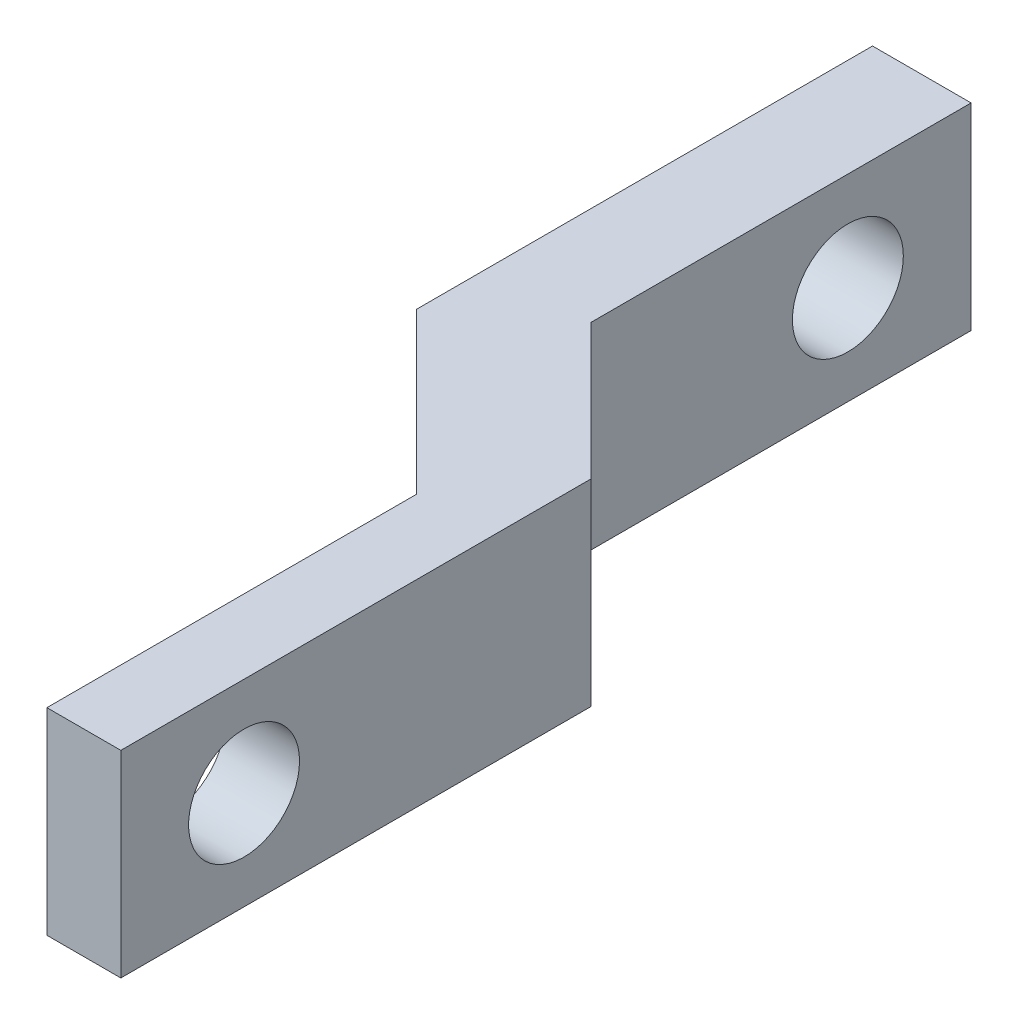
ISO-10303-21;
HEADER;
FILE_DESCRIPTION(('STEP AP214'),'2;1');
FILE_NAME('part.step','',(''),(''),'','','');
FILE_SCHEMA(('AUTOMOTIVE_DESIGN { 1 0 10303 214 1 1 1 1 }'));
ENDSEC;
DATA;
#1=APPLICATION_CONTEXT('core data for automotive mechanical design processes');
#2=APPLICATION_PROTOCOL_DEFINITION('international standard','automotive_design',2000,#1);
#3=PRODUCT_CONTEXT('',#1,'mechanical');
#4=PRODUCT('Part','Part','',(#3));
#5=PRODUCT_RELATED_PRODUCT_CATEGORY('part','',(#4));
#6=PRODUCT_DEFINITION_FORMATION('','',#4);
#7=PRODUCT_DEFINITION_CONTEXT('part definition',#1,'design');
#8=PRODUCT_DEFINITION('design','',#6,#7);
#9=PRODUCT_DEFINITION_SHAPE('','',#8);
#10=(LENGTH_UNIT() NAMED_UNIT(*) SI_UNIT(.MILLI.,.METRE.));
#11=(NAMED_UNIT(*) PLANE_ANGLE_UNIT() SI_UNIT($,.RADIAN.));
#12=(NAMED_UNIT(*) SI_UNIT($,.STERADIAN.) SOLID_ANGLE_UNIT());
#13=UNCERTAINTY_MEASURE_WITH_UNIT(LENGTH_MEASURE(1.E-05),#10,'distance_accuracy_value','');
#14=(GEOMETRIC_REPRESENTATION_CONTEXT(3) GLOBAL_UNCERTAINTY_ASSIGNED_CONTEXT((#13)) GLOBAL_UNIT_ASSIGNED_CONTEXT((#10,
#11,#12)) REPRESENTATION_CONTEXT('',''));
#15=CARTESIAN_POINT('',(0.,0.,0.));
#16=DIRECTION('',(0.,0.,1.));
#17=DIRECTION('',(1.,0.,0.));
#18=AXIS2_PLACEMENT_3D('',#15,#16,#17);
#19=CARTESIAN_POINT('',(0.,8.,-19.0710678118655));
#20=DIRECTION('',(-1.,0.,0.));
#21=DIRECTION('',(0.,0.,1.));
#22=AXIS2_PLACEMENT_3D('',#19,#20,#21);
#23=PLANE('',#22);
#24=CARTESIAN_POINT('',(0.,4.,-5.00000000000002));
#25=DIRECTION('',(1.,0.,0.));
#26=DIRECTION('',(0.,0.,-1.));
#27=AXIS2_PLACEMENT_3D('',#24,#25,#26);
#28=CIRCLE('',#27,2.25);
#29=CARTESIAN_POINT('',(0.,4.,-7.25000000000002));
#30=VERTEX_POINT('',#29);
#31=EDGE_CURVE('E183',#30,#30,#28,.T.);
#32=ORIENTED_EDGE('',*,*,#31,.F.);
#33=EDGE_LOOP('',(#32));
#34=FACE_BOUND('',#33,.T.);
#35=DIRECTION('',(0.,0.,-1.));
#36=VECTOR('',#35,1.);
#37=CARTESIAN_POINT('',(0.,0.,-19.0710678118655));
#38=LINE('',#37,#36);
#39=CARTESIAN_POINT('',(0.,0.,0.));
#40=VERTEX_POINT('',#39);
#41=CARTESIAN_POINT('',(0.,0.,-19.0710678118655));
#42=VERTEX_POINT('',#41);
#43=EDGE_CURVE('E129',#40,#42,#38,.T.);
#44=ORIENTED_EDGE('',*,*,#43,.T.);
#45=DIRECTION('',(0.,-1.,0.));
#46=VECTOR('',#45,1.);
#47=CARTESIAN_POINT('',(0.,8.,-19.0710678118655));
#48=LINE('',#47,#46);
#49=CARTESIAN_POINT('',(0.,8.,-19.0710678118655));
#50=VERTEX_POINT('',#49);
#51=EDGE_CURVE('E11',#50,#42,#48,.T.);
#52=ORIENTED_EDGE('',*,*,#51,.F.);
#53=DIRECTION('',(0.,0.,-1.));
#54=VECTOR('',#53,1.);
#55=CARTESIAN_POINT('',(0.,8.,-19.0710678118655));
#56=LINE('',#55,#54);
#57=CARTESIAN_POINT('',(0.,8.,0.));
#58=VERTEX_POINT('',#57);
#59=EDGE_CURVE('E144',#58,#50,#56,.T.);
#60=ORIENTED_EDGE('',*,*,#59,.F.);
#61=DIRECTION('',(0.,-1.,0.));
#62=VECTOR('',#61,1.);
#63=CARTESIAN_POINT('',(0.,8.,0.));
#64=LINE('',#63,#62);
#65=EDGE_CURVE('E125',#58,#40,#64,.T.);
#66=ORIENTED_EDGE('',*,*,#65,.T.);
#67=EDGE_LOOP('',(#44,#52,#60,#66));
#68=FACE_BOUND('',#67,.T.);
#69=ADVANCED_FACE('F32',(#34,#68),#23,.F.);
#70=CARTESIAN_POINT('',(-5.5,8.,-24.5710678118655));
#71=DIRECTION('',(-0.707106781186551,0.,0.707106781186544));
#72=DIRECTION('',(0.707106781186544,0.,0.707106781186551));
#73=AXIS2_PLACEMENT_3D('',#70,#71,#72);
#74=PLANE('',#73);
#75=DIRECTION('',(-0.707106781186544,0.,-0.707106781186551));
#76=VECTOR('',#75,1.);
#77=CARTESIAN_POINT('',(-5.5,0.,-24.5710678118655));
#78=LINE('',#77,#76);
#79=CARTESIAN_POINT('',(-5.5,0.,-24.5710678118655));
#80=VERTEX_POINT('',#79);
#81=EDGE_CURVE('E132',#42,#80,#78,.T.);
#82=ORIENTED_EDGE('',*,*,#81,.T.);
#83=DIRECTION('',(0.,-1.,0.));
#84=VECTOR('',#83,1.);
#85=CARTESIAN_POINT('',(-5.5,8.,-24.5710678118655));
#86=LINE('',#85,#84);
#87=CARTESIAN_POINT('',(-5.5,8.,-24.5710678118655));
#88=VERTEX_POINT('',#87);
#89=EDGE_CURVE('E41',#88,#80,#86,.T.);
#90=ORIENTED_EDGE('',*,*,#89,.F.);
#91=DIRECTION('',(-0.707106781186544,0.,-0.707106781186551));
#92=VECTOR('',#91,1.);
#93=CARTESIAN_POINT('',(-5.5,8.,-24.5710678118655));
#94=LINE('',#93,#92);
#95=EDGE_CURVE('E92',#50,#88,#94,.T.);
#96=ORIENTED_EDGE('',*,*,#95,.F.);
#97=ORIENTED_EDGE('',*,*,#51,.T.);
#98=EDGE_LOOP('',(#82,#90,#96,#97));
#99=FACE_BOUND('',#98,.T.);
#100=ADVANCED_FACE('F201',(#99),#74,.F.);
#101=CARTESIAN_POINT('',(-5.5,8.,-40.));
#102=DIRECTION('',(-1.,0.,0.));
#103=DIRECTION('',(0.,0.,1.));
#104=AXIS2_PLACEMENT_3D('',#101,#102,#103);
#105=PLANE('',#104);
#106=CARTESIAN_POINT('',(-5.5,4.,-35.));
#107=DIRECTION('',(-1.,0.,0.));
#108=DIRECTION('',(0.,0.,1.));
#109=AXIS2_PLACEMENT_3D('',#106,#107,#108);
#110=CIRCLE('',#109,2.24999999999999);
#111=CARTESIAN_POINT('',(-5.5,4.,-32.75));
#112=VERTEX_POINT('',#111);
#113=EDGE_CURVE('E133',#112,#112,#110,.T.);
#114=ORIENTED_EDGE('',*,*,#113,.T.);
#115=EDGE_LOOP('',(#114));
#116=FACE_BOUND('',#115,.T.);
#117=DIRECTION('',(0.,0.,-1.));
#118=VECTOR('',#117,1.);
#119=CARTESIAN_POINT('',(-5.5,0.,-40.));
#120=LINE('',#119,#118);
#121=CARTESIAN_POINT('',(-5.5,0.,-40.));
#122=VERTEX_POINT('',#121);
#123=EDGE_CURVE('E135',#80,#122,#120,.T.);
#124=ORIENTED_EDGE('',*,*,#123,.T.);
#125=DIRECTION('',(0.,-1.,0.));
#126=VECTOR('',#125,1.);
#127=CARTESIAN_POINT('',(-5.5,8.,-40.));
#128=LINE('',#127,#126);
#129=CARTESIAN_POINT('',(-5.5,8.,-40.));
#130=VERTEX_POINT('',#129);
#131=EDGE_CURVE('E151',#130,#122,#128,.T.);
#132=ORIENTED_EDGE('',*,*,#131,.F.);
#133=DIRECTION('',(0.,0.,-1.));
#134=VECTOR('',#133,1.);
#135=CARTESIAN_POINT('',(-5.5,8.,-40.));
#136=LINE('',#135,#134);
#137=EDGE_CURVE('E160',#88,#130,#136,.T.);
#138=ORIENTED_EDGE('',*,*,#137,.F.);
#139=ORIENTED_EDGE('',*,*,#89,.T.);
#140=EDGE_LOOP('',(#124,#132,#138,#139));
#141=FACE_BOUND('',#140,.T.);
#142=ADVANCED_FACE('F158',(#116,#141),#105,.F.);
#143=CARTESIAN_POINT('',(-9.5,8.,-40.));
#144=DIRECTION('',(0.,0.,1.));
#145=DIRECTION('',(1.,0.,0.));
#146=AXIS2_PLACEMENT_3D('',#143,#144,#145);
#147=PLANE('',#146);
#148=DIRECTION('',(-1.,0.,0.));
#149=VECTOR('',#148,1.);
#150=CARTESIAN_POINT('',(-9.5,0.,-40.));
#151=LINE('',#150,#149);
#152=CARTESIAN_POINT('',(-9.5,0.,-40.));
#153=VERTEX_POINT('',#152);
#154=EDGE_CURVE('E137',#122,#153,#151,.T.);
#155=ORIENTED_EDGE('',*,*,#154,.T.);
#156=DIRECTION('',(0.,-1.,0.));
#157=VECTOR('',#156,1.);
#158=CARTESIAN_POINT('',(-9.5,8.,-40.));
#159=LINE('',#158,#157);
#160=CARTESIAN_POINT('',(-9.5,8.,-40.));
#161=VERTEX_POINT('',#160);
#162=EDGE_CURVE('E148',#161,#153,#159,.T.);
#163=ORIENTED_EDGE('',*,*,#162,.F.);
#164=DIRECTION('',(-1.,0.,0.));
#165=VECTOR('',#164,1.);
#166=CARTESIAN_POINT('',(-9.5,8.,-40.));
#167=LINE('',#166,#165);
#168=EDGE_CURVE('E172',#130,#161,#167,.T.);
#169=ORIENTED_EDGE('',*,*,#168,.F.);
#170=ORIENTED_EDGE('',*,*,#131,.T.);
#171=EDGE_LOOP('',(#155,#163,#169,#170));
#172=FACE_BOUND('',#171,.T.);
#173=ADVANCED_FACE('F168',(#172),#147,.F.);
#174=CARTESIAN_POINT('',(-9.5,8.,-21.5000000000001));
#175=DIRECTION('',(1.,0.,0.));
#176=DIRECTION('',(0.,0.,-1.));
#177=AXIS2_PLACEMENT_3D('',#174,#175,#176);
#178=PLANE('',#177);
#179=CARTESIAN_POINT('',(-9.50000000000001,4.,-35.));
#180=DIRECTION('',(1.,0.,0.));
#181=DIRECTION('',(0.,0.,-1.));
#182=AXIS2_PLACEMENT_3D('',#179,#180,#181);
#183=CIRCLE('',#182,2.24999999999999);
#184=CARTESIAN_POINT('',(-9.50000000000001,4.,-37.25));
#185=VERTEX_POINT('',#184);
#186=EDGE_CURVE('E180',#185,#185,#183,.T.);
#187=ORIENTED_EDGE('',*,*,#186,.T.);
#188=EDGE_LOOP('',(#187));
#189=FACE_BOUND('',#188,.T.);
#190=DIRECTION('',(0.,0.,1.));
#191=VECTOR('',#190,1.);
#192=CARTESIAN_POINT('',(-9.5,0.,-21.5000000000001));
#193=LINE('',#192,#191);
#194=CARTESIAN_POINT('',(-9.5,0.,-21.5000000000001));
#195=VERTEX_POINT('',#194);
#196=EDGE_CURVE('E139',#153,#195,#193,.T.);
#197=ORIENTED_EDGE('',*,*,#196,.T.);
#198=DIRECTION('',(0.,-1.,0.));
#199=VECTOR('',#198,1.);
#200=CARTESIAN_POINT('',(-9.5,8.,-21.5000000000001));
#201=LINE('',#200,#199);
#202=CARTESIAN_POINT('',(-9.5,8.,-21.5000000000001));
#203=VERTEX_POINT('',#202);
#204=EDGE_CURVE('E120',#203,#195,#201,.T.);
#205=ORIENTED_EDGE('',*,*,#204,.F.);
#206=DIRECTION('',(0.,0.,1.));
#207=VECTOR('',#206,1.);
#208=CARTESIAN_POINT('',(-9.5,8.,-21.5000000000001));
#209=LINE('',#208,#207);
#210=EDGE_CURVE('E111',#161,#203,#209,.T.);
#211=ORIENTED_EDGE('',*,*,#210,.F.);
#212=ORIENTED_EDGE('',*,*,#162,.T.);
#213=EDGE_LOOP('',(#197,#205,#211,#212));
#214=FACE_BOUND('',#213,.T.);
#215=ADVANCED_FACE('F171',(#189,#214),#178,.F.);
#216=CARTESIAN_POINT('',(-3.,8.,-15.));
#217=DIRECTION('',(0.707106781186551,0.,-0.707106781186544));
#218=DIRECTION('',(-0.707106781186544,0.,-0.707106781186551));
#219=AXIS2_PLACEMENT_3D('',#216,#217,#218);
#220=PLANE('',#219);
#221=DIRECTION('',(0.707106781186544,0.,0.707106781186551));
#222=VECTOR('',#221,1.);
#223=CARTESIAN_POINT('',(-3.,0.,-15.));
#224=LINE('',#223,#222);
#225=CARTESIAN_POINT('',(-3.,0.,-15.));
#226=VERTEX_POINT('',#225);
#227=EDGE_CURVE('E119',#195,#226,#224,.T.);
#228=ORIENTED_EDGE('',*,*,#227,.T.);
#229=DIRECTION('',(0.,-1.,0.));
#230=VECTOR('',#229,1.);
#231=CARTESIAN_POINT('',(-3.,8.,-15.));
#232=LINE('',#231,#230);
#233=CARTESIAN_POINT('',(-3.,8.,-15.));
#234=VERTEX_POINT('',#233);
#235=EDGE_CURVE('E116',#234,#226,#232,.T.);
#236=ORIENTED_EDGE('',*,*,#235,.F.);
#237=DIRECTION('',(0.707106781186544,0.,0.707106781186551));
#238=VECTOR('',#237,1.);
#239=CARTESIAN_POINT('',(-3.,8.,-15.));
#240=LINE('',#239,#238);
#241=EDGE_CURVE('E105',#203,#234,#240,.T.);
#242=ORIENTED_EDGE('',*,*,#241,.F.);
#243=ORIENTED_EDGE('',*,*,#204,.T.);
#244=EDGE_LOOP('',(#228,#236,#242,#243));
#245=FACE_BOUND('',#244,.T.);
#246=ADVANCED_FACE('F117',(#245),#220,.F.);
#247=CARTESIAN_POINT('',(-3.,8.,0.));
#248=DIRECTION('',(1.,0.,0.));
#249=DIRECTION('',(0.,0.,-1.));
#250=AXIS2_PLACEMENT_3D('',#247,#248,#249);
#251=PLANE('',#250);
#252=CARTESIAN_POINT('',(-3.,4.,-5.00000000000003));
#253=DIRECTION('',(1.,0.,0.));
#254=DIRECTION('',(0.,0.,-1.));
#255=AXIS2_PLACEMENT_3D('',#252,#253,#254);
#256=CIRCLE('',#255,2.25);
#257=CARTESIAN_POINT('',(-3.,4.,-7.25000000000003));
#258=VERTEX_POINT('',#257);
#259=EDGE_CURVE('E35',#258,#258,#256,.T.);
#260=ORIENTED_EDGE('',*,*,#259,.T.);
#261=EDGE_LOOP('',(#260));
#262=FACE_BOUND('',#261,.T.);
#263=DIRECTION('',(0.,0.,1.));
#264=VECTOR('',#263,1.);
#265=CARTESIAN_POINT('',(-3.,0.,0.));
#266=LINE('',#265,#264);
#267=CARTESIAN_POINT('',(-3.,0.,0.));
#268=VERTEX_POINT('',#267);
#269=EDGE_CURVE('E78',#226,#268,#266,.T.);
#270=ORIENTED_EDGE('',*,*,#269,.T.);
#271=DIRECTION('',(0.,-1.,0.));
#272=VECTOR('',#271,1.);
#273=CARTESIAN_POINT('',(-3.,8.,0.));
#274=LINE('',#273,#272);
#275=CARTESIAN_POINT('',(-3.,8.,0.));
#276=VERTEX_POINT('',#275);
#277=EDGE_CURVE('E121',#276,#268,#274,.T.);
#278=ORIENTED_EDGE('',*,*,#277,.F.);
#279=DIRECTION('',(0.,0.,1.));
#280=VECTOR('',#279,1.);
#281=CARTESIAN_POINT('',(-3.,8.,0.));
#282=LINE('',#281,#280);
#283=EDGE_CURVE('E109',#234,#276,#282,.T.);
#284=ORIENTED_EDGE('',*,*,#283,.F.);
#285=ORIENTED_EDGE('',*,*,#235,.T.);
#286=EDGE_LOOP('',(#270,#278,#284,#285));
#287=FACE_BOUND('',#286,.T.);
#288=ADVANCED_FACE('F123',(#262,#287),#251,.F.);
#289=CARTESIAN_POINT('',(0.,8.,0.));
#290=DIRECTION('',(0.,0.,-1.));
#291=DIRECTION('',(-1.,0.,0.));
#292=AXIS2_PLACEMENT_3D('',#289,#290,#291);
#293=PLANE('',#292);
#294=DIRECTION('',(1.,0.,0.));
#295=VECTOR('',#294,1.);
#296=CARTESIAN_POINT('',(0.,0.,0.));
#297=LINE('',#296,#295);
#298=EDGE_CURVE('E84',#268,#40,#297,.T.);
#299=ORIENTED_EDGE('',*,*,#298,.T.);
#300=ORIENTED_EDGE('',*,*,#65,.F.);
#301=DIRECTION('',(1.,0.,0.));
#302=VECTOR('',#301,1.);
#303=CARTESIAN_POINT('',(0.,8.,0.));
#304=LINE('',#303,#302);
#305=EDGE_CURVE('E49',#276,#58,#304,.T.);
#306=ORIENTED_EDGE('',*,*,#305,.F.);
#307=ORIENTED_EDGE('',*,*,#277,.T.);
#308=EDGE_LOOP('',(#299,#300,#306,#307));
#309=FACE_BOUND('',#308,.T.);
#310=ADVANCED_FACE('F209',(#309),#293,.F.);
#311=CARTESIAN_POINT('',(0.,8.,0.));
#312=DIRECTION('',(0.,-1.,0.));
#313=DIRECTION('',(0.,0.,-1.));
#314=AXIS2_PLACEMENT_3D('',#311,#312,#313);
#315=PLANE('',#314);
#316=ORIENTED_EDGE('',*,*,#59,.T.);
#317=ORIENTED_EDGE('',*,*,#95,.T.);
#318=ORIENTED_EDGE('',*,*,#137,.T.);
#319=ORIENTED_EDGE('',*,*,#168,.T.);
#320=ORIENTED_EDGE('',*,*,#210,.T.);
#321=ORIENTED_EDGE('',*,*,#241,.T.);
#322=ORIENTED_EDGE('',*,*,#283,.T.);
#323=ORIENTED_EDGE('',*,*,#305,.T.);
#324=EDGE_LOOP('',(#316,#317,#318,#319,#320,#321,#322,#323));
#325=FACE_BOUND('',#324,.T.);
#326=ADVANCED_FACE('F107',(#325),#315,.F.);
#327=CARTESIAN_POINT('',(0.,0.,0.));
#328=DIRECTION('',(0.,-1.,0.));
#329=DIRECTION('',(0.,0.,-1.));
#330=AXIS2_PLACEMENT_3D('',#327,#328,#329);
#331=PLANE('',#330);
#332=ORIENTED_EDGE('',*,*,#43,.F.);
#333=ORIENTED_EDGE('',*,*,#298,.F.);
#334=ORIENTED_EDGE('',*,*,#269,.F.);
#335=ORIENTED_EDGE('',*,*,#227,.F.);
#336=ORIENTED_EDGE('',*,*,#196,.F.);
#337=ORIENTED_EDGE('',*,*,#154,.F.);
#338=ORIENTED_EDGE('',*,*,#123,.F.);
#339=ORIENTED_EDGE('',*,*,#81,.F.);
#340=EDGE_LOOP('',(#332,#333,#334,#335,#336,#337,#338,#339));
#341=FACE_BOUND('',#340,.T.);
#342=ADVANCED_FACE('F164',(#341),#331,.T.);
#343=CARTESIAN_POINT('',(-9.50000000000001,4.,-35.));
#344=DIRECTION('',(1.,0.,0.));
#345=DIRECTION('',(0.,0.,-1.));
#346=AXIS2_PLACEMENT_3D('',#343,#344,#345);
#347=CYLINDRICAL_SURFACE('',#346,2.24999999999999);
#348=ORIENTED_EDGE('',*,*,#186,.F.);
#349=EDGE_LOOP('',(#348));
#350=FACE_BOUND('',#349,.T.);
#351=ORIENTED_EDGE('',*,*,#113,.F.);
#352=EDGE_LOOP('',(#351));
#353=FACE_BOUND('',#352,.T.);
#354=ADVANCED_FACE('F193',(#350,#353),#347,.F.);
#355=CARTESIAN_POINT('',(-9.50000000000008,4.,-5.00000000000004));
#356=DIRECTION('',(1.,0.,0.));
#357=DIRECTION('',(0.,0.,-1.));
#358=AXIS2_PLACEMENT_3D('',#355,#356,#357);
#359=CYLINDRICAL_SURFACE('',#358,2.25);
#360=ORIENTED_EDGE('',*,*,#31,.T.);
#361=EDGE_LOOP('',(#360));
#362=FACE_BOUND('',#361,.T.);
#363=ORIENTED_EDGE('',*,*,#259,.F.);
#364=EDGE_LOOP('',(#363));
#365=FACE_BOUND('',#364,.T.);
#366=ADVANCED_FACE('F191',(#362,#365),#359,.F.);
#367=CLOSED_SHELL('',(#69,#100,#142,#173,#215,#246,#288,#310,#326,#342,#354,#366));
#368=MANIFOLD_SOLID_BREP('B2',#367);
#369=ADVANCED_BREP_SHAPE_REPRESENTATION('',(#18,#368),#14);
#370=SHAPE_DEFINITION_REPRESENTATION(#9,#369);
ENDSEC;
END-ISO-10303-21;
